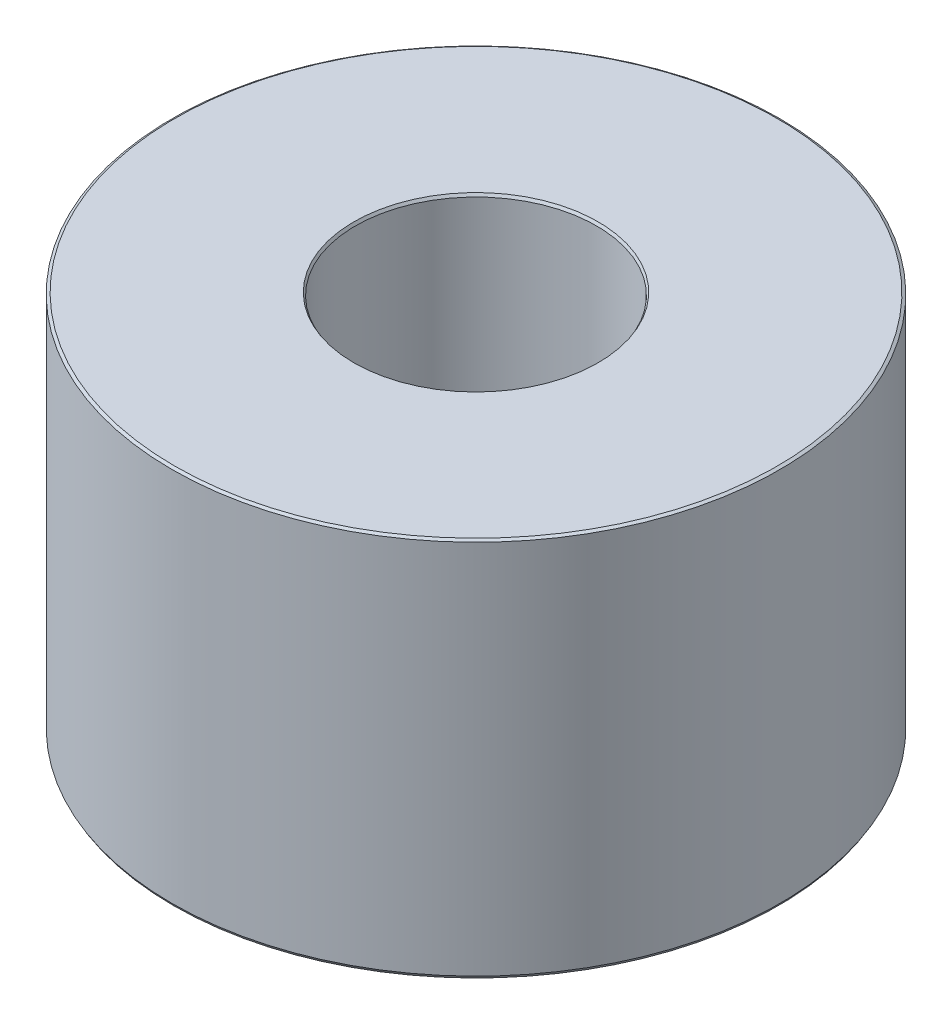
ISO-10303-21;
HEADER;
FILE_DESCRIPTION(('STEP AP214'),'2;1');
FILE_NAME('part.step','',(''),(''),'','','');
FILE_SCHEMA(('AUTOMOTIVE_DESIGN { 1 0 10303 214 1 1 1 1 }'));
ENDSEC;
DATA;
#1=APPLICATION_CONTEXT('core data for automotive mechanical design processes');
#2=APPLICATION_PROTOCOL_DEFINITION('international standard','automotive_design',2000,#1);
#3=PRODUCT_CONTEXT('',#1,'mechanical');
#4=PRODUCT('Part','Part','',(#3));
#5=PRODUCT_RELATED_PRODUCT_CATEGORY('part','',(#4));
#6=PRODUCT_DEFINITION_FORMATION('','',#4);
#7=PRODUCT_DEFINITION_CONTEXT('part definition',#1,'design');
#8=PRODUCT_DEFINITION('design','',#6,#7);
#9=PRODUCT_DEFINITION_SHAPE('','',#8);
#10=(LENGTH_UNIT() NAMED_UNIT(*) SI_UNIT(.MILLI.,.METRE.));
#11=(NAMED_UNIT(*) PLANE_ANGLE_UNIT() SI_UNIT($,.RADIAN.));
#12=(NAMED_UNIT(*) SI_UNIT($,.STERADIAN.) SOLID_ANGLE_UNIT());
#13=UNCERTAINTY_MEASURE_WITH_UNIT(LENGTH_MEASURE(1.E-05),#10,'distance_accuracy_value','');
#14=(GEOMETRIC_REPRESENTATION_CONTEXT(3) GLOBAL_UNCERTAINTY_ASSIGNED_CONTEXT((#13)) GLOBAL_UNIT_ASSIGNED_CONTEXT((#10,
#11,#12)) REPRESENTATION_CONTEXT('',''));
#15=CARTESIAN_POINT('',(0.,0.,0.));
#16=DIRECTION('',(0.,0.,1.));
#17=DIRECTION('',(1.,0.,0.));
#18=AXIS2_PLACEMENT_3D('',#15,#16,#17);
#19=CARTESIAN_POINT('',(0.,53.1539178513637,0.));
#20=DIRECTION('',(0.,-1.,0.));
#21=DIRECTION('',(0.,0.,-1.));
#22=AXIS2_PLACEMENT_3D('',#19,#20,#21);
#23=CYLINDRICAL_SURFACE('',#22,42.5);
#24=CARTESIAN_POINT('',(0.,0.382390716304082,0.));
#25=DIRECTION('',(0.,1.,0.));
#26=DIRECTION('',(0.,0.,1.));
#27=AXIS2_PLACEMENT_3D('',#24,#25,#26);
#28=CIRCLE('',#27,42.5);
#29=CARTESIAN_POINT('',(0.,0.382390716304082,42.5));
#30=VERTEX_POINT('',#29);
#31=EDGE_CURVE('E10',#30,#30,#28,.T.);
#32=ORIENTED_EDGE('',*,*,#31,.T.);
#33=EDGE_LOOP('',(#32));
#34=FACE_BOUND('',#33,.T.);
#35=CARTESIAN_POINT('',(0.,52.9331444683699,0.));
#36=DIRECTION('',(0.,1.,0.));
#37=DIRECTION('',(0.,0.,1.));
#38=AXIS2_PLACEMENT_3D('',#35,#36,#37);
#39=CIRCLE('',#38,42.5);
#40=CARTESIAN_POINT('',(0.,52.9331444683699,42.5));
#41=VERTEX_POINT('',#40);
#42=EDGE_CURVE('E50',#41,#41,#39,.F.);
#43=ORIENTED_EDGE('',*,*,#42,.T.);
#44=EDGE_LOOP('',(#43));
#45=FACE_BOUND('',#44,.T.);
#46=ADVANCED_FACE('F39',(#34,#45),#23,.T.);
#47=CARTESIAN_POINT('',(0.,53.1539178513637,0.));
#48=DIRECTION('',(0.,1.,0.));
#49=DIRECTION('',(0.,0.,1.));
#50=AXIS2_PLACEMENT_3D('',#47,#48,#49);
#51=PLANE('',#50);
#52=CARTESIAN_POINT('',(0.,53.1539178513637,0.));
#53=DIRECTION('',(0.,1.,0.));
#54=DIRECTION('',(0.,0.,1.));
#55=AXIS2_PLACEMENT_3D('',#52,#53,#54);
#56=CIRCLE('',#55,17.0819855064147);
#57=CARTESIAN_POINT('',(0.,53.1539178513637,17.0819855064147));
#58=VERTEX_POINT('',#57);
#59=EDGE_CURVE('E58',#58,#58,#56,.F.);
#60=ORIENTED_EDGE('',*,*,#59,.T.);
#61=EDGE_LOOP('',(#60));
#62=FACE_BOUND('',#61,.T.);
#63=CARTESIAN_POINT('',(0.,53.1539178513637,0.));
#64=DIRECTION('',(0.,1.,0.));
#65=DIRECTION('',(0.,0.,1.));
#66=AXIS2_PLACEMENT_3D('',#63,#64,#65);
#67=CIRCLE('',#66,42.1176092836959);
#68=CARTESIAN_POINT('',(0.,53.1539178513637,42.1176092836959));
#69=VERTEX_POINT('',#68);
#70=EDGE_CURVE('E61',#69,#69,#67,.T.);
#71=ORIENTED_EDGE('',*,*,#70,.T.);
#72=EDGE_LOOP('',(#71));
#73=FACE_BOUND('',#72,.T.);
#74=ADVANCED_FACE('F88',(#62,#73),#51,.T.);
#75=CARTESIAN_POINT('',(0.,0.,0.));
#76=DIRECTION('',(0.,1.,0.));
#77=DIRECTION('',(0.,0.,1.));
#78=AXIS2_PLACEMENT_3D('',#75,#76,#77);
#79=PLANE('',#78);
#80=CARTESIAN_POINT('',(0.,0.,0.));
#81=DIRECTION('',(0.,1.,0.));
#82=DIRECTION('',(0.,0.,1.));
#83=AXIS2_PLACEMENT_3D('',#80,#81,#82);
#84=CIRCLE('',#83,17.243602839725);
#85=CARTESIAN_POINT('',(0.,0.,17.243602839725));
#86=VERTEX_POINT('',#85);
#87=EDGE_CURVE('E51',#86,#86,#84,.T.);
#88=ORIENTED_EDGE('',*,*,#87,.T.);
#89=EDGE_LOOP('',(#88));
#90=FACE_BOUND('',#89,.T.);
#91=CARTESIAN_POINT('',(0.,0.,0.));
#92=DIRECTION('',(0.,1.,0.));
#93=DIRECTION('',(0.,0.,1.));
#94=AXIS2_PLACEMENT_3D('',#91,#92,#93);
#95=CIRCLE('',#94,42.2792266170062);
#96=CARTESIAN_POINT('',(0.,0.,42.2792266170062));
#97=VERTEX_POINT('',#96);
#98=EDGE_CURVE('E54',#97,#97,#95,.F.);
#99=ORIENTED_EDGE('',*,*,#98,.T.);
#100=EDGE_LOOP('',(#99));
#101=FACE_BOUND('',#100,.T.);
#102=ADVANCED_FACE('F83',(#90,#101),#79,.F.);
#103=CARTESIAN_POINT('',(0.,53.1539178513637,0.));
#104=DIRECTION('',(0.,-1.,0.));
#105=DIRECTION('',(0.,0.,-1.));
#106=AXIS2_PLACEMENT_3D('',#103,#104,#105);
#107=CYLINDRICAL_SURFACE('',#106,16.861212123421);
#108=CARTESIAN_POINT('',(0.,52.7715271350596,0.));
#109=DIRECTION('',(0.,1.,0.));
#110=DIRECTION('',(0.,0.,1.));
#111=AXIS2_PLACEMENT_3D('',#108,#109,#110);
#112=CIRCLE('',#111,16.861212123421);
#113=CARTESIAN_POINT('',(0.,52.7715271350596,16.861212123421));
#114=VERTEX_POINT('',#113);
#115=EDGE_CURVE('E67',#114,#114,#112,.T.);
#116=ORIENTED_EDGE('',*,*,#115,.T.);
#117=EDGE_LOOP('',(#116));
#118=FACE_BOUND('',#117,.T.);
#119=CARTESIAN_POINT('',(0.,0.220773382993769,0.));
#120=DIRECTION('',(0.,1.,0.));
#121=DIRECTION('',(0.,0.,1.));
#122=AXIS2_PLACEMENT_3D('',#119,#120,#121);
#123=CIRCLE('',#122,16.861212123421);
#124=CARTESIAN_POINT('',(0.,0.220773382993769,16.861212123421));
#125=VERTEX_POINT('',#124);
#126=EDGE_CURVE('E69',#125,#125,#123,.F.);
#127=ORIENTED_EDGE('',*,*,#126,.T.);
#128=EDGE_LOOP('',(#127));
#129=FACE_BOUND('',#128,.T.);
#130=ADVANCED_FACE('F71',(#118,#129),#107,.F.);
#131=CARTESIAN_POINT('',(0.,52.7715271350596,0.));
#132=DIRECTION('',(0.,1.,0.));
#133=DIRECTION('',(0.,0.,1.));
#134=AXIS2_PLACEMENT_3D('',#131,#132,#133);
#135=CONICAL_SURFACE('',#134,16.861212123421,0.523598775598291);
#136=ORIENTED_EDGE('',*,*,#59,.F.);
#137=EDGE_LOOP('',(#136));
#138=FACE_BOUND('',#137,.T.);
#139=ORIENTED_EDGE('',*,*,#115,.F.);
#140=EDGE_LOOP('',(#139));
#141=FACE_BOUND('',#140,.T.);
#142=ADVANCED_FACE('F77',(#138,#141),#135,.F.);
#143=CARTESIAN_POINT('',(0.,0.,0.));
#144=DIRECTION('',(0.,-1.,0.));
#145=DIRECTION('',(0.,0.,-1.));
#146=AXIS2_PLACEMENT_3D('',#143,#144,#145);
#147=CONICAL_SURFACE('',#146,17.243602839725,1.04719755119659);
#148=ORIENTED_EDGE('',*,*,#126,.F.);
#149=EDGE_LOOP('',(#148));
#150=FACE_BOUND('',#149,.T.);
#151=ORIENTED_EDGE('',*,*,#87,.F.);
#152=EDGE_LOOP('',(#151));
#153=FACE_BOUND('',#152,.T.);
#154=ADVANCED_FACE('F73',(#150,#153),#147,.F.);
#155=CARTESIAN_POINT('',(0.,0.382390716304082,0.));
#156=DIRECTION('',(0.,1.,0.));
#157=DIRECTION('',(0.,0.,1.));
#158=AXIS2_PLACEMENT_3D('',#155,#156,#157);
#159=CONICAL_SURFACE('',#158,42.5,0.5235987755983);
#160=ORIENTED_EDGE('',*,*,#98,.F.);
#161=EDGE_LOOP('',(#160));
#162=FACE_BOUND('',#161,.T.);
#163=ORIENTED_EDGE('',*,*,#31,.F.);
#164=EDGE_LOOP('',(#163));
#165=FACE_BOUND('',#164,.T.);
#166=ADVANCED_FACE('F76',(#162,#165),#159,.T.);
#167=CARTESIAN_POINT('',(0.,53.1539178513637,0.));
#168=DIRECTION('',(0.,-1.,0.));
#169=DIRECTION('',(0.,0.,-1.));
#170=AXIS2_PLACEMENT_3D('',#167,#168,#169);
#171=CONICAL_SURFACE('',#170,42.1176092836959,1.04719755119657);
#172=ORIENTED_EDGE('',*,*,#42,.F.);
#173=EDGE_LOOP('',(#172));
#174=FACE_BOUND('',#173,.T.);
#175=ORIENTED_EDGE('',*,*,#70,.F.);
#176=EDGE_LOOP('',(#175));
#177=FACE_BOUND('',#176,.T.);
#178=ADVANCED_FACE('F45',(#174,#177),#171,.T.);
#179=CLOSED_SHELL('',(#46,#74,#102,#130,#142,#154,#166,#178));
#180=MANIFOLD_SOLID_BREP('B2',#179);
#181=ADVANCED_BREP_SHAPE_REPRESENTATION('',(#18,#180),#14);
#182=SHAPE_DEFINITION_REPRESENTATION(#9,#181);
ENDSEC;
END-ISO-10303-21;
